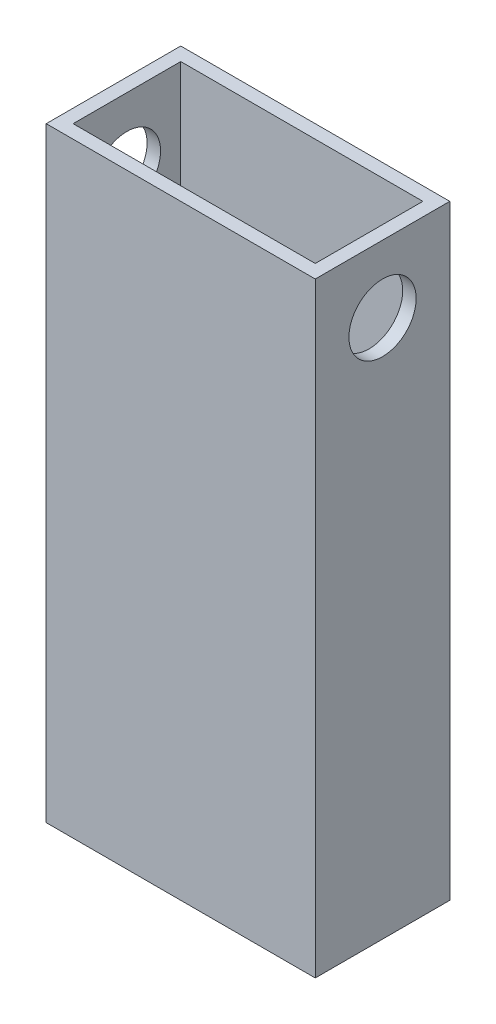
ISO-10303-21;
HEADER;
FILE_DESCRIPTION(('STEP AP214'),'2;1');
FILE_NAME('part.step','',(''),(''),'','','');
FILE_SCHEMA(('AUTOMOTIVE_DESIGN { 1 0 10303 214 1 1 1 1 }'));
ENDSEC;
DATA;
#1=APPLICATION_CONTEXT('core data for automotive mechanical design processes');
#2=APPLICATION_PROTOCOL_DEFINITION('international standard','automotive_design',2000,#1);
#3=PRODUCT_CONTEXT('',#1,'mechanical');
#4=PRODUCT('Part','Part','',(#3));
#5=PRODUCT_RELATED_PRODUCT_CATEGORY('part','',(#4));
#6=PRODUCT_DEFINITION_FORMATION('','',#4);
#7=PRODUCT_DEFINITION_CONTEXT('part definition',#1,'design');
#8=PRODUCT_DEFINITION('design','',#6,#7);
#9=PRODUCT_DEFINITION_SHAPE('','',#8);
#10=(LENGTH_UNIT() NAMED_UNIT(*) SI_UNIT(.MILLI.,.METRE.));
#11=(NAMED_UNIT(*) PLANE_ANGLE_UNIT() SI_UNIT($,.RADIAN.));
#12=(NAMED_UNIT(*) SI_UNIT($,.STERADIAN.) SOLID_ANGLE_UNIT());
#13=UNCERTAINTY_MEASURE_WITH_UNIT(LENGTH_MEASURE(1.E-05),#10,'distance_accuracy_value','');
#14=(GEOMETRIC_REPRESENTATION_CONTEXT(3) GLOBAL_UNCERTAINTY_ASSIGNED_CONTEXT((#13)) GLOBAL_UNIT_ASSIGNED_CONTEXT((#10,
#11,#12)) REPRESENTATION_CONTEXT('',''));
#15=CARTESIAN_POINT('',(0.,0.,0.));
#16=DIRECTION('',(0.,0.,1.));
#17=DIRECTION('',(1.,0.,0.));
#18=AXIS2_PLACEMENT_3D('',#15,#16,#17);
#19=CARTESIAN_POINT('',(0.,114.3,0.));
#20=DIRECTION('',(0.,1.,0.));
#21=DIRECTION('',(0.,0.,1.));
#22=AXIS2_PLACEMENT_3D('',#19,#20,#21);
#23=PLANE('',#22);
#24=DIRECTION('',(0.,0.,1.));
#25=VECTOR('',#24,1.);
#26=CARTESIAN_POINT('',(0.,114.3,0.));
#27=LINE('',#26,#25);
#28=CARTESIAN_POINT('',(0.,114.3,-25.4));
#29=VERTEX_POINT('',#28);
#30=CARTESIAN_POINT('',(0.,114.3,0.));
#31=VERTEX_POINT('',#30);
#32=EDGE_CURVE('E161',#29,#31,#27,.T.);
#33=ORIENTED_EDGE('',*,*,#32,.T.);
#34=DIRECTION('',(1.,0.,0.));
#35=VECTOR('',#34,1.);
#36=CARTESIAN_POINT('',(0.,114.3,0.));
#37=LINE('',#36,#35);
#38=CARTESIAN_POINT('',(50.8,114.3,0.));
#39=VERTEX_POINT('',#38);
#40=EDGE_CURVE('E164',#31,#39,#37,.T.);
#41=ORIENTED_EDGE('',*,*,#40,.T.);
#42=DIRECTION('',(0.,0.,-1.));
#43=VECTOR('',#42,1.);
#44=CARTESIAN_POINT('',(50.8,114.3,0.));
#45=LINE('',#44,#43);
#46=CARTESIAN_POINT('',(50.8,114.3,-25.4));
#47=VERTEX_POINT('',#46);
#48=EDGE_CURVE('E167',#39,#47,#45,.T.);
#49=ORIENTED_EDGE('',*,*,#48,.T.);
#50=DIRECTION('',(-1.,0.,0.));
#51=VECTOR('',#50,1.);
#52=CARTESIAN_POINT('',(0.,114.3,-25.4));
#53=LINE('',#52,#51);
#54=EDGE_CURVE('E169',#47,#29,#53,.T.);
#55=ORIENTED_EDGE('',*,*,#54,.T.);
#56=EDGE_LOOP('',(#33,#41,#49,#55));
#57=FACE_BOUND('',#56,.T.);
#58=DIRECTION('',(1.,0.,0.));
#59=VECTOR('',#58,1.);
#60=CARTESIAN_POINT('',(0.,114.3,-2.54));
#61=LINE('',#60,#59);
#62=CARTESIAN_POINT('',(2.54,114.3,-2.54));
#63=VERTEX_POINT('',#62);
#64=CARTESIAN_POINT('',(48.26,114.3,-2.54));
#65=VERTEX_POINT('',#64);
#66=EDGE_CURVE('E131',#63,#65,#61,.T.);
#67=ORIENTED_EDGE('',*,*,#66,.F.);
#68=DIRECTION('',(0.,0.,1.));
#69=VECTOR('',#68,1.);
#70=CARTESIAN_POINT('',(2.54,114.3,0.));
#71=LINE('',#70,#69);
#72=CARTESIAN_POINT('',(2.54,114.3,-22.86));
#73=VERTEX_POINT('',#72);
#74=EDGE_CURVE('E123',#73,#63,#71,.T.);
#75=ORIENTED_EDGE('',*,*,#74,.F.);
#76=DIRECTION('',(-1.,0.,0.));
#77=VECTOR('',#76,1.);
#78=CARTESIAN_POINT('',(0.,114.3,-22.86));
#79=LINE('',#78,#77);
#80=CARTESIAN_POINT('',(48.26,114.3,-22.86));
#81=VERTEX_POINT('',#80);
#82=EDGE_CURVE('E145',#81,#73,#79,.T.);
#83=ORIENTED_EDGE('',*,*,#82,.F.);
#84=DIRECTION('',(0.,0.,-1.));
#85=VECTOR('',#84,1.);
#86=CARTESIAN_POINT('',(48.26,114.3,0.));
#87=LINE('',#86,#85);
#88=EDGE_CURVE('E143',#65,#81,#87,.T.);
#89=ORIENTED_EDGE('',*,*,#88,.F.);
#90=EDGE_LOOP('',(#67,#75,#83,#89));
#91=FACE_BOUND('',#90,.T.);
#92=ADVANCED_FACE('F57',(#57,#91),#23,.T.);
#93=CARTESIAN_POINT('',(0.,0.,0.));
#94=DIRECTION('',(0.,1.,0.));
#95=DIRECTION('',(0.,0.,1.));
#96=AXIS2_PLACEMENT_3D('',#93,#94,#95);
#97=PLANE('',#96);
#98=DIRECTION('',(0.,0.,1.));
#99=VECTOR('',#98,1.);
#100=CARTESIAN_POINT('',(0.,0.,0.));
#101=LINE('',#100,#99);
#102=CARTESIAN_POINT('',(0.,0.,-25.4));
#103=VERTEX_POINT('',#102);
#104=CARTESIAN_POINT('',(0.,0.,0.));
#105=VERTEX_POINT('',#104);
#106=EDGE_CURVE('E139',#103,#105,#101,.T.);
#107=ORIENTED_EDGE('',*,*,#106,.F.);
#108=DIRECTION('',(-1.,0.,0.));
#109=VECTOR('',#108,1.);
#110=CARTESIAN_POINT('',(0.,0.,-25.4));
#111=LINE('',#110,#109);
#112=CARTESIAN_POINT('',(50.8,0.,-25.4));
#113=VERTEX_POINT('',#112);
#114=EDGE_CURVE('E165',#113,#103,#111,.T.);
#115=ORIENTED_EDGE('',*,*,#114,.F.);
#116=DIRECTION('',(0.,0.,-1.));
#117=VECTOR('',#116,1.);
#118=CARTESIAN_POINT('',(50.8,0.,0.));
#119=LINE('',#118,#117);
#120=CARTESIAN_POINT('',(50.8,0.,0.));
#121=VERTEX_POINT('',#120);
#122=EDGE_CURVE('E176',#121,#113,#119,.T.);
#123=ORIENTED_EDGE('',*,*,#122,.F.);
#124=DIRECTION('',(1.,0.,0.));
#125=VECTOR('',#124,1.);
#126=CARTESIAN_POINT('',(0.,0.,0.));
#127=LINE('',#126,#125);
#128=EDGE_CURVE('E174',#105,#121,#127,.T.);
#129=ORIENTED_EDGE('',*,*,#128,.F.);
#130=EDGE_LOOP('',(#107,#115,#123,#129));
#131=FACE_BOUND('',#130,.T.);
#132=DIRECTION('',(0.,0.,1.));
#133=VECTOR('',#132,1.);
#134=CARTESIAN_POINT('',(2.54,0.,0.));
#135=LINE('',#134,#133);
#136=CARTESIAN_POINT('',(2.54,0.,-22.86));
#137=VERTEX_POINT('',#136);
#138=CARTESIAN_POINT('',(2.54,0.,-2.54));
#139=VERTEX_POINT('',#138);
#140=EDGE_CURVE('E81',#137,#139,#135,.T.);
#141=ORIENTED_EDGE('',*,*,#140,.T.);
#142=DIRECTION('',(1.,0.,0.));
#143=VECTOR('',#142,1.);
#144=CARTESIAN_POINT('',(0.,0.,-2.54));
#145=LINE('',#144,#143);
#146=CARTESIAN_POINT('',(48.26,0.,-2.54));
#147=VERTEX_POINT('',#146);
#148=EDGE_CURVE('E138',#139,#147,#145,.T.);
#149=ORIENTED_EDGE('',*,*,#148,.T.);
#150=DIRECTION('',(0.,0.,-1.));
#151=VECTOR('',#150,1.);
#152=CARTESIAN_POINT('',(48.26,0.,0.));
#153=LINE('',#152,#151);
#154=CARTESIAN_POINT('',(48.26,0.,-22.86));
#155=VERTEX_POINT('',#154);
#156=EDGE_CURVE('E153',#147,#155,#153,.T.);
#157=ORIENTED_EDGE('',*,*,#156,.T.);
#158=DIRECTION('',(-1.,0.,0.));
#159=VECTOR('',#158,1.);
#160=CARTESIAN_POINT('',(0.,0.,-22.86));
#161=LINE('',#160,#159);
#162=EDGE_CURVE('E132',#155,#137,#161,.T.);
#163=ORIENTED_EDGE('',*,*,#162,.T.);
#164=EDGE_LOOP('',(#141,#149,#157,#163));
#165=FACE_BOUND('',#164,.T.);
#166=ADVANCED_FACE('F195',(#131,#165),#97,.F.);
#167=CARTESIAN_POINT('',(0.,114.3,0.));
#168=DIRECTION('',(1.,0.,0.));
#169=DIRECTION('',(0.,0.,-1.));
#170=AXIS2_PLACEMENT_3D('',#167,#168,#169);
#171=PLANE('',#170);
#172=CARTESIAN_POINT('',(0.,101.6,-12.7));
#173=DIRECTION('',(1.,0.,0.));
#174=DIRECTION('',(0.,0.,-1.));
#175=AXIS2_PLACEMENT_3D('',#172,#173,#174);
#176=CIRCLE('',#175,6.35);
#177=CARTESIAN_POINT('',(0.,101.6,-19.05));
#178=VERTEX_POINT('',#177);
#179=EDGE_CURVE('E236',#178,#178,#176,.T.);
#180=ORIENTED_EDGE('',*,*,#179,.T.);
#181=EDGE_LOOP('',(#180));
#182=FACE_BOUND('',#181,.T.);
#183=ORIENTED_EDGE('',*,*,#106,.T.);
#184=DIRECTION('',(0.,-1.,0.));
#185=VECTOR('',#184,1.);
#186=CARTESIAN_POINT('',(0.,114.3,0.));
#187=LINE('',#186,#185);
#188=EDGE_CURVE('E12',#31,#105,#187,.T.);
#189=ORIENTED_EDGE('',*,*,#188,.F.);
#190=ORIENTED_EDGE('',*,*,#32,.F.);
#191=DIRECTION('',(0.,-1.,0.));
#192=VECTOR('',#191,1.);
#193=CARTESIAN_POINT('',(0.,114.3,-25.4));
#194=LINE('',#193,#192);
#195=EDGE_CURVE('E171',#29,#103,#194,.T.);
#196=ORIENTED_EDGE('',*,*,#195,.T.);
#197=EDGE_LOOP('',(#183,#189,#190,#196));
#198=FACE_BOUND('',#197,.T.);
#199=ADVANCED_FACE('F59',(#182,#198),#171,.F.);
#200=CARTESIAN_POINT('',(0.,114.3,0.));
#201=DIRECTION('',(0.,0.,-1.));
#202=DIRECTION('',(-1.,0.,0.));
#203=AXIS2_PLACEMENT_3D('',#200,#201,#202);
#204=PLANE('',#203);
#205=ORIENTED_EDGE('',*,*,#128,.T.);
#206=DIRECTION('',(0.,-1.,0.));
#207=VECTOR('',#206,1.);
#208=CARTESIAN_POINT('',(50.8,114.3,0.));
#209=LINE('',#208,#207);
#210=EDGE_CURVE('E66',#39,#121,#209,.T.);
#211=ORIENTED_EDGE('',*,*,#210,.F.);
#212=ORIENTED_EDGE('',*,*,#40,.F.);
#213=ORIENTED_EDGE('',*,*,#188,.T.);
#214=EDGE_LOOP('',(#205,#211,#212,#213));
#215=FACE_BOUND('',#214,.T.);
#216=ADVANCED_FACE('F205',(#215),#204,.F.);
#217=CARTESIAN_POINT('',(50.8,114.3,0.));
#218=DIRECTION('',(-1.,0.,0.));
#219=DIRECTION('',(0.,0.,1.));
#220=AXIS2_PLACEMENT_3D('',#217,#218,#219);
#221=PLANE('',#220);
#222=CARTESIAN_POINT('',(50.8,101.6,-12.7));
#223=DIRECTION('',(1.,0.,0.));
#224=DIRECTION('',(0.,0.,-1.));
#225=AXIS2_PLACEMENT_3D('',#222,#223,#224);
#226=CIRCLE('',#225,6.35);
#227=CARTESIAN_POINT('',(50.8,101.6,-19.05));
#228=VERTEX_POINT('',#227);
#229=EDGE_CURVE('E238',#228,#228,#226,.T.);
#230=ORIENTED_EDGE('',*,*,#229,.F.);
#231=EDGE_LOOP('',(#230));
#232=FACE_BOUND('',#231,.T.);
#233=ORIENTED_EDGE('',*,*,#122,.T.);
#234=DIRECTION('',(0.,-1.,0.));
#235=VECTOR('',#234,1.);
#236=CARTESIAN_POINT('',(50.8,114.3,-25.4));
#237=LINE('',#236,#235);
#238=EDGE_CURVE('E181',#47,#113,#237,.T.);
#239=ORIENTED_EDGE('',*,*,#238,.F.);
#240=ORIENTED_EDGE('',*,*,#48,.F.);
#241=ORIENTED_EDGE('',*,*,#210,.T.);
#242=EDGE_LOOP('',(#233,#239,#240,#241));
#243=FACE_BOUND('',#242,.T.);
#244=ADVANCED_FACE('F189',(#232,#243),#221,.F.);
#245=CARTESIAN_POINT('',(0.,114.3,-25.4));
#246=DIRECTION('',(0.,0.,1.));
#247=DIRECTION('',(1.,0.,0.));
#248=AXIS2_PLACEMENT_3D('',#245,#246,#247);
#249=PLANE('',#248);
#250=ORIENTED_EDGE('',*,*,#114,.T.);
#251=ORIENTED_EDGE('',*,*,#195,.F.);
#252=ORIENTED_EDGE('',*,*,#54,.F.);
#253=ORIENTED_EDGE('',*,*,#238,.T.);
#254=EDGE_LOOP('',(#250,#251,#252,#253));
#255=FACE_BOUND('',#254,.T.);
#256=ADVANCED_FACE('F199',(#255),#249,.F.);
#257=CARTESIAN_POINT('',(2.54,114.3,0.));
#258=DIRECTION('',(1.,0.,0.));
#259=DIRECTION('',(0.,0.,-1.));
#260=AXIS2_PLACEMENT_3D('',#257,#258,#259);
#261=PLANE('',#260);
#262=CARTESIAN_POINT('',(2.54,101.6,-12.7));
#263=DIRECTION('',(1.,0.,0.));
#264=DIRECTION('',(0.,0.,-1.));
#265=AXIS2_PLACEMENT_3D('',#262,#263,#264);
#266=CIRCLE('',#265,6.35);
#267=CARTESIAN_POINT('',(2.54,101.6,-19.05));
#268=VERTEX_POINT('',#267);
#269=EDGE_CURVE('E151',#268,#268,#266,.T.);
#270=ORIENTED_EDGE('',*,*,#269,.F.);
#271=EDGE_LOOP('',(#270));
#272=FACE_BOUND('',#271,.T.);
#273=ORIENTED_EDGE('',*,*,#140,.F.);
#274=DIRECTION('',(0.,-1.,0.));
#275=VECTOR('',#274,1.);
#276=CARTESIAN_POINT('',(2.54,114.3,-22.86));
#277=LINE('',#276,#275);
#278=EDGE_CURVE('E127',#73,#137,#277,.T.);
#279=ORIENTED_EDGE('',*,*,#278,.F.);
#280=ORIENTED_EDGE('',*,*,#74,.T.);
#281=DIRECTION('',(0.,-1.,0.));
#282=VECTOR('',#281,1.);
#283=CARTESIAN_POINT('',(2.54,114.3,-2.54));
#284=LINE('',#283,#282);
#285=EDGE_CURVE('E126',#63,#139,#284,.T.);
#286=ORIENTED_EDGE('',*,*,#285,.T.);
#287=EDGE_LOOP('',(#273,#279,#280,#286));
#288=FACE_BOUND('',#287,.T.);
#289=ADVANCED_FACE('F125',(#272,#288),#261,.T.);
#290=CARTESIAN_POINT('',(0.,114.3,-2.54));
#291=DIRECTION('',(0.,0.,-1.));
#292=DIRECTION('',(-1.,0.,0.));
#293=AXIS2_PLACEMENT_3D('',#290,#291,#292);
#294=PLANE('',#293);
#295=ORIENTED_EDGE('',*,*,#148,.F.);
#296=ORIENTED_EDGE('',*,*,#285,.F.);
#297=ORIENTED_EDGE('',*,*,#66,.T.);
#298=DIRECTION('',(0.,-1.,0.));
#299=VECTOR('',#298,1.);
#300=CARTESIAN_POINT('',(48.26,114.3,-2.54));
#301=LINE('',#300,#299);
#302=EDGE_CURVE('E140',#65,#147,#301,.T.);
#303=ORIENTED_EDGE('',*,*,#302,.T.);
#304=EDGE_LOOP('',(#295,#296,#297,#303));
#305=FACE_BOUND('',#304,.T.);
#306=ADVANCED_FACE('F135',(#305),#294,.T.);
#307=CARTESIAN_POINT('',(48.26,114.3,0.));
#308=DIRECTION('',(-1.,0.,0.));
#309=DIRECTION('',(0.,0.,1.));
#310=AXIS2_PLACEMENT_3D('',#307,#308,#309);
#311=PLANE('',#310);
#312=CARTESIAN_POINT('',(48.26,101.6,-12.7));
#313=DIRECTION('',(-1.,0.,0.));
#314=DIRECTION('',(0.,0.,1.));
#315=AXIS2_PLACEMENT_3D('',#312,#313,#314);
#316=CIRCLE('',#315,6.35);
#317=CARTESIAN_POINT('',(48.26,101.6,-6.35));
#318=VERTEX_POINT('',#317);
#319=EDGE_CURVE('E61',#318,#318,#316,.T.);
#320=ORIENTED_EDGE('',*,*,#319,.F.);
#321=EDGE_LOOP('',(#320));
#322=FACE_BOUND('',#321,.T.);
#323=ORIENTED_EDGE('',*,*,#156,.F.);
#324=ORIENTED_EDGE('',*,*,#302,.F.);
#325=ORIENTED_EDGE('',*,*,#88,.T.);
#326=DIRECTION('',(0.,-1.,0.));
#327=VECTOR('',#326,1.);
#328=CARTESIAN_POINT('',(48.26,114.3,-22.86));
#329=LINE('',#328,#327);
#330=EDGE_CURVE('E73',#81,#155,#329,.T.);
#331=ORIENTED_EDGE('',*,*,#330,.T.);
#332=EDGE_LOOP('',(#323,#324,#325,#331));
#333=FACE_BOUND('',#332,.T.);
#334=ADVANCED_FACE('F231',(#322,#333),#311,.T.);
#335=CARTESIAN_POINT('',(0.,114.3,-22.86));
#336=DIRECTION('',(0.,0.,1.));
#337=DIRECTION('',(1.,0.,0.));
#338=AXIS2_PLACEMENT_3D('',#335,#336,#337);
#339=PLANE('',#338);
#340=ORIENTED_EDGE('',*,*,#162,.F.);
#341=ORIENTED_EDGE('',*,*,#330,.F.);
#342=ORIENTED_EDGE('',*,*,#82,.T.);
#343=ORIENTED_EDGE('',*,*,#278,.T.);
#344=EDGE_LOOP('',(#340,#341,#342,#343));
#345=FACE_BOUND('',#344,.T.);
#346=ADVANCED_FACE('F251',(#345),#339,.T.);
#347=CARTESIAN_POINT('',(0.,101.6,-12.7));
#348=DIRECTION('',(1.,0.,0.));
#349=DIRECTION('',(0.,0.,-1.));
#350=AXIS2_PLACEMENT_3D('',#347,#348,#349);
#351=CYLINDRICAL_SURFACE('',#350,6.35);
#352=ORIENTED_EDGE('',*,*,#319,.T.);
#353=EDGE_LOOP('',(#352));
#354=FACE_BOUND('',#353,.T.);
#355=ORIENTED_EDGE('',*,*,#229,.T.);
#356=EDGE_LOOP('',(#355));
#357=FACE_BOUND('',#356,.T.);
#358=ADVANCED_FACE('F246',(#354,#357),#351,.F.);
#359=ORIENTED_EDGE('',*,*,#269,.T.);
#360=EDGE_LOOP('',(#359));
#361=FACE_BOUND('',#360,.T.);
#362=ORIENTED_EDGE('',*,*,#179,.F.);
#363=EDGE_LOOP('',(#362));
#364=FACE_BOUND('',#363,.T.);
#365=ADVANCED_FACE('F244',(#361,#364),#351,.F.);
#366=CLOSED_SHELL('',(#92,#166,#199,#216,#244,#256,#289,#306,#334,#346,#358,#365));
#367=MANIFOLD_SOLID_BREP('B2',#366);
#368=ADVANCED_BREP_SHAPE_REPRESENTATION('',(#18,#367),#14);
#369=SHAPE_DEFINITION_REPRESENTATION(#9,#368);
ENDSEC;
END-ISO-10303-21;
